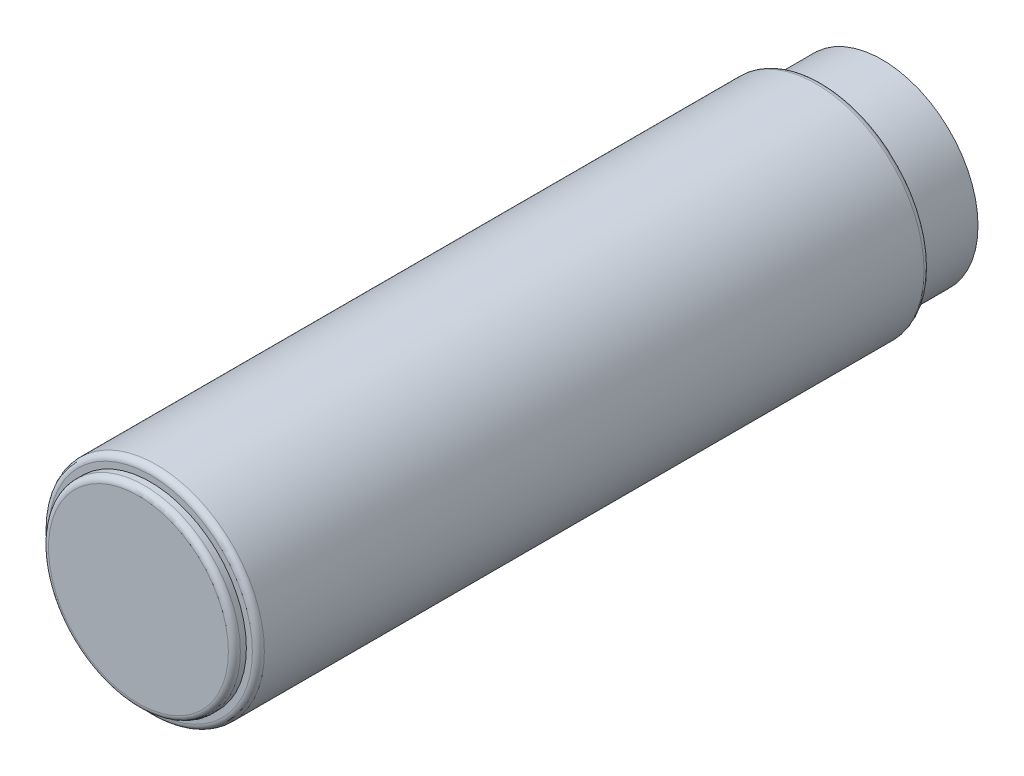
ISO-10303-21;
HEADER;
FILE_DESCRIPTION(('STEP AP214'),'2;1');
FILE_NAME('part.step','',(''),(''),'','','');
FILE_SCHEMA(('AUTOMOTIVE_DESIGN { 1 0 10303 214 1 1 1 1 }'));
ENDSEC;
DATA;
#1=APPLICATION_CONTEXT('core data for automotive mechanical design processes');
#2=APPLICATION_PROTOCOL_DEFINITION('international standard','automotive_design',2000,#1);
#3=PRODUCT_CONTEXT('',#1,'mechanical');
#4=PRODUCT('Part','Part','',(#3));
#5=PRODUCT_RELATED_PRODUCT_CATEGORY('part','',(#4));
#6=PRODUCT_DEFINITION_FORMATION('','',#4);
#7=PRODUCT_DEFINITION_CONTEXT('part definition',#1,'design');
#8=PRODUCT_DEFINITION('design','',#6,#7);
#9=PRODUCT_DEFINITION_SHAPE('','',#8);
#10=(LENGTH_UNIT() NAMED_UNIT(*) SI_UNIT(.MILLI.,.METRE.));
#11=(NAMED_UNIT(*) PLANE_ANGLE_UNIT() SI_UNIT($,.RADIAN.));
#12=(NAMED_UNIT(*) SI_UNIT($,.STERADIAN.) SOLID_ANGLE_UNIT());
#13=UNCERTAINTY_MEASURE_WITH_UNIT(LENGTH_MEASURE(1.E-05),#10,'distance_accuracy_value','');
#14=(GEOMETRIC_REPRESENTATION_CONTEXT(3) GLOBAL_UNCERTAINTY_ASSIGNED_CONTEXT((#13)) GLOBAL_UNIT_ASSIGNED_CONTEXT((#10,
#11,#12)) REPRESENTATION_CONTEXT('',''));
#15=CARTESIAN_POINT('',(0.,0.,0.));
#16=DIRECTION('',(0.,0.,1.));
#17=DIRECTION('',(1.,0.,0.));
#18=AXIS2_PLACEMENT_3D('',#15,#16,#17);
#19=CARTESIAN_POINT('',(0.,0.,-5.));
#20=DIRECTION('',(0.,0.,1.));
#21=DIRECTION('',(1.,0.,0.));
#22=AXIS2_PLACEMENT_3D('',#19,#20,#21);
#23=CYLINDRICAL_SURFACE('',#22,8.);
#24=CARTESIAN_POINT('',(0.,0.,-5.));
#25=DIRECTION('',(0.,0.,-1.));
#26=DIRECTION('',(-1.,0.,0.));
#27=AXIS2_PLACEMENT_3D('',#24,#25,#26);
#28=CIRCLE('',#27,8.);
#29=CARTESIAN_POINT('',(-8.,0.,-5.));
#30=VERTEX_POINT('',#29);
#31=EDGE_CURVE('E11',#30,#30,#28,.T.);
#32=ORIENTED_EDGE('',*,*,#31,.F.);
#33=EDGE_LOOP('',(#32));
#34=FACE_BOUND('',#33,.T.);
#35=CARTESIAN_POINT('',(0.,0.,0.));
#36=DIRECTION('',(0.,0.,-1.));
#37=DIRECTION('',(-1.,0.,0.));
#38=AXIS2_PLACEMENT_3D('',#35,#36,#37);
#39=CIRCLE('',#38,8.);
#40=CARTESIAN_POINT('',(-8.,0.,0.));
#41=VERTEX_POINT('',#40);
#42=EDGE_CURVE('E43',#41,#41,#39,.T.);
#43=ORIENTED_EDGE('',*,*,#42,.T.);
#44=EDGE_LOOP('',(#43));
#45=FACE_BOUND('',#44,.T.);
#46=ADVANCED_FACE('F40',(#34,#45),#23,.T.);
#47=CARTESIAN_POINT('',(0.,0.,-5.));
#48=DIRECTION('',(0.,0.,-1.));
#49=DIRECTION('',(-1.,0.,0.));
#50=AXIS2_PLACEMENT_3D('',#47,#48,#49);
#51=PLANE('',#50);
#52=ORIENTED_EDGE('',*,*,#31,.T.);
#53=EDGE_LOOP('',(#52));
#54=FACE_BOUND('',#53,.T.);
#55=ADVANCED_FACE('F55',(#54),#51,.T.);
#56=CARTESIAN_POINT('',(0.,0.,0.));
#57=DIRECTION('',(0.,0.,-1.));
#58=DIRECTION('',(-1.,0.,0.));
#59=AXIS2_PLACEMENT_3D('',#56,#57,#58);
#60=PLANE('',#59);
#61=ORIENTED_EDGE('',*,*,#42,.F.);
#62=EDGE_LOOP('',(#61));
#63=FACE_BOUND('',#62,.T.);
#64=ADVANCED_FACE('F53',(#63),#60,.F.);
#65=CLOSED_SHELL('',(#46,#55,#64));
#66=MANIFOLD_SOLID_BREP('B2',#65);
#67=CARTESIAN_POINT('',(0.,0.,57.));
#68=DIRECTION('',(0.,0.,-1.));
#69=DIRECTION('',(-1.,0.,0.));
#70=AXIS2_PLACEMENT_3D('',#67,#68,#69);
#71=CYLINDRICAL_SURFACE('',#70,8.);
#72=CARTESIAN_POINT('',(0.,0.,56.5));
#73=DIRECTION('',(0.,0.,1.));
#74=DIRECTION('',(1.,0.,0.));
#75=AXIS2_PLACEMENT_3D('',#72,#73,#74);
#76=CIRCLE('',#75,8.);
#77=CARTESIAN_POINT('',(8.,0.,56.5));
#78=VERTEX_POINT('',#77);
#79=EDGE_CURVE('E39',#78,#78,#76,.F.);
#80=ORIENTED_EDGE('',*,*,#79,.T.);
#81=EDGE_LOOP('',(#80));
#82=FACE_BOUND('',#81,.T.);
#83=CARTESIAN_POINT('',(0.,0.,56.));
#84=DIRECTION('',(0.,0.,1.));
#85=DIRECTION('',(1.,0.,0.));
#86=AXIS2_PLACEMENT_3D('',#83,#84,#85);
#87=CIRCLE('',#86,8.);
#88=CARTESIAN_POINT('',(8.,0.,56.));
#89=VERTEX_POINT('',#88);
#90=EDGE_CURVE('E99',#89,#89,#87,.T.);
#91=ORIENTED_EDGE('',*,*,#90,.T.);
#92=EDGE_LOOP('',(#91));
#93=FACE_BOUND('',#92,.T.);
#94=ADVANCED_FACE('F88',(#82,#93),#71,.T.);
#95=CARTESIAN_POINT('',(0.,0.,57.));
#96=DIRECTION('',(0.,0.,1.));
#97=DIRECTION('',(1.,0.,0.));
#98=AXIS2_PLACEMENT_3D('',#95,#96,#97);
#99=PLANE('',#98);
#100=CARTESIAN_POINT('',(0.,0.,57.));
#101=DIRECTION('',(0.,0.,1.));
#102=DIRECTION('',(1.,0.,0.));
#103=AXIS2_PLACEMENT_3D('',#100,#101,#102);
#104=CIRCLE('',#103,7.5);
#105=CARTESIAN_POINT('',(7.5,0.,57.));
#106=VERTEX_POINT('',#105);
#107=EDGE_CURVE('E95',#106,#106,#104,.T.);
#108=ORIENTED_EDGE('',*,*,#107,.T.);
#109=EDGE_LOOP('',(#108));
#110=FACE_BOUND('',#109,.T.);
#111=ADVANCED_FACE('F109',(#110),#99,.T.);
#112=CARTESIAN_POINT('',(0.,0.,56.));
#113=DIRECTION('',(0.,0.,1.));
#114=DIRECTION('',(1.,0.,0.));
#115=AXIS2_PLACEMENT_3D('',#112,#113,#114);
#116=PLANE('',#115);
#117=ORIENTED_EDGE('',*,*,#90,.F.);
#118=EDGE_LOOP('',(#117));
#119=FACE_BOUND('',#118,.T.);
#120=ADVANCED_FACE('F107',(#119),#116,.F.);
#121=CARTESIAN_POINT('',(0.,0.,56.5));
#122=DIRECTION('',(0.,0.,1.));
#123=DIRECTION('',(1.,0.,0.));
#124=AXIS2_PLACEMENT_3D('',#121,#122,#123);
#125=TOROIDAL_SURFACE('',#124,7.5,0.5);
#126=ORIENTED_EDGE('',*,*,#79,.F.);
#127=EDGE_LOOP('',(#126));
#128=FACE_BOUND('',#127,.T.);
#129=ORIENTED_EDGE('',*,*,#107,.F.);
#130=EDGE_LOOP('',(#129));
#131=FACE_BOUND('',#130,.T.);
#132=ADVANCED_FACE('F90',(#128,#131),#125,.T.);
#133=CLOSED_SHELL('',(#94,#111,#120,#132));
#134=MANIFOLD_SOLID_BREP('B6',#133);
#135=CARTESIAN_POINT('',(0.,0.,56.));
#136=DIRECTION('',(0.,0.,-1.));
#137=DIRECTION('',(-1.,0.,0.));
#138=AXIS2_PLACEMENT_3D('',#135,#136,#137);
#139=CYLINDRICAL_SURFACE('',#138,9.);
#140=CARTESIAN_POINT('',(0.,0.,0.5));
#141=DIRECTION('',(0.,0.,1.));
#142=DIRECTION('',(1.,0.,0.));
#143=AXIS2_PLACEMENT_3D('',#140,#141,#142);
#144=CIRCLE('',#143,9.);
#145=CARTESIAN_POINT('',(9.,0.,0.5));
#146=VERTEX_POINT('',#145);
#147=EDGE_CURVE('E153',#146,#146,#144,.T.);
#148=ORIENTED_EDGE('',*,*,#147,.T.);
#149=EDGE_LOOP('',(#148));
#150=FACE_BOUND('',#149,.T.);
#151=CARTESIAN_POINT('',(0.,0.,55.5));
#152=DIRECTION('',(0.,0.,1.));
#153=DIRECTION('',(1.,0.,0.));
#154=AXIS2_PLACEMENT_3D('',#151,#152,#153);
#155=CIRCLE('',#154,9.);
#156=CARTESIAN_POINT('',(9.,0.,55.5));
#157=VERTEX_POINT('',#156);
#158=EDGE_CURVE('E157',#157,#157,#155,.F.);
#159=ORIENTED_EDGE('',*,*,#158,.T.);
#160=EDGE_LOOP('',(#159));
#161=FACE_BOUND('',#160,.T.);
#162=ADVANCED_FACE('F146',(#150,#161),#139,.T.);
#163=CARTESIAN_POINT('',(0.,0.,56.));
#164=DIRECTION('',(0.,0.,1.));
#165=DIRECTION('',(1.,0.,0.));
#166=AXIS2_PLACEMENT_3D('',#163,#164,#165);
#167=PLANE('',#166);
#168=CARTESIAN_POINT('',(0.,0.,56.));
#169=DIRECTION('',(0.,0.,1.));
#170=DIRECTION('',(1.,0.,0.));
#171=AXIS2_PLACEMENT_3D('',#168,#169,#170);
#172=CIRCLE('',#171,8.5);
#173=CARTESIAN_POINT('',(8.5,0.,56.));
#174=VERTEX_POINT('',#173);
#175=EDGE_CURVE('E161',#174,#174,#172,.T.);
#176=ORIENTED_EDGE('',*,*,#175,.T.);
#177=EDGE_LOOP('',(#176));
#178=FACE_BOUND('',#177,.T.);
#179=ADVANCED_FACE('F167',(#178),#167,.T.);
#180=CARTESIAN_POINT('',(0.,0.,0.));
#181=DIRECTION('',(0.,0.,1.));
#182=DIRECTION('',(1.,0.,0.));
#183=AXIS2_PLACEMENT_3D('',#180,#181,#182);
#184=PLANE('',#183);
#185=CARTESIAN_POINT('',(0.,0.,0.));
#186=DIRECTION('',(0.,0.,1.));
#187=DIRECTION('',(1.,0.,0.));
#188=AXIS2_PLACEMENT_3D('',#185,#186,#187);
#189=CIRCLE('',#188,8.5);
#190=CARTESIAN_POINT('',(8.5,0.,0.));
#191=VERTEX_POINT('',#190);
#192=EDGE_CURVE('E87',#191,#191,#189,.F.);
#193=ORIENTED_EDGE('',*,*,#192,.T.);
#194=EDGE_LOOP('',(#193));
#195=FACE_BOUND('',#194,.T.);
#196=ADVANCED_FACE('F171',(#195),#184,.F.);
#197=CARTESIAN_POINT('',(0.,0.,55.5));
#198=DIRECTION('',(0.,0.,1.));
#199=DIRECTION('',(1.,0.,0.));
#200=AXIS2_PLACEMENT_3D('',#197,#198,#199);
#201=TOROIDAL_SURFACE('',#200,8.5,0.5);
#202=ORIENTED_EDGE('',*,*,#158,.F.);
#203=EDGE_LOOP('',(#202));
#204=FACE_BOUND('',#203,.T.);
#205=ORIENTED_EDGE('',*,*,#175,.F.);
#206=EDGE_LOOP('',(#205));
#207=FACE_BOUND('',#206,.T.);
#208=ADVANCED_FACE('F169',(#204,#207),#201,.T.);
#209=CARTESIAN_POINT('',(0.,0.,0.5));
#210=DIRECTION('',(0.,0.,1.));
#211=DIRECTION('',(1.,0.,0.));
#212=AXIS2_PLACEMENT_3D('',#209,#210,#211);
#213=TOROIDAL_SURFACE('',#212,8.5,0.5);
#214=ORIENTED_EDGE('',*,*,#192,.F.);
#215=EDGE_LOOP('',(#214));
#216=FACE_BOUND('',#215,.T.);
#217=ORIENTED_EDGE('',*,*,#147,.F.);
#218=EDGE_LOOP('',(#217));
#219=FACE_BOUND('',#218,.T.);
#220=ADVANCED_FACE('F148',(#216,#219),#213,.T.);
#221=CLOSED_SHELL('',(#162,#179,#196,#208,#220));
#222=MANIFOLD_SOLID_BREP('B34',#221);
#223=ADVANCED_BREP_SHAPE_REPRESENTATION('',(#18,#66,#134,#222),#14);
#224=SHAPE_DEFINITION_REPRESENTATION(#9,#223);
ENDSEC;
END-ISO-10303-21;
